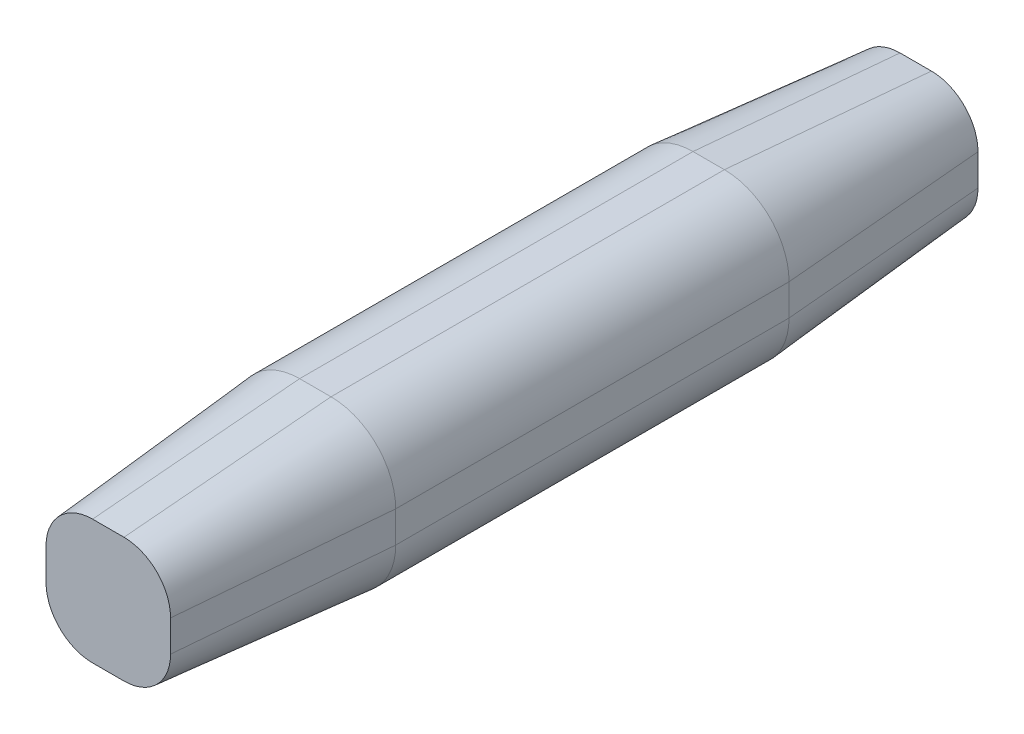
ISO-10303-21;
HEADER;
FILE_DESCRIPTION(('STEP AP214'),'2;1');
FILE_NAME('part.step','',(''),(''),'','','');
FILE_SCHEMA(('AUTOMOTIVE_DESIGN { 1 0 10303 214 1 1 1 1 }'));
ENDSEC;
DATA;
#1=APPLICATION_CONTEXT('core data for automotive mechanical design processes');
#2=APPLICATION_PROTOCOL_DEFINITION('international standard','automotive_design',2000,#1);
#3=PRODUCT_CONTEXT('',#1,'mechanical');
#4=PRODUCT('Part','Part','',(#3));
#5=PRODUCT_RELATED_PRODUCT_CATEGORY('part','',(#4));
#6=PRODUCT_DEFINITION_FORMATION('','',#4);
#7=PRODUCT_DEFINITION_CONTEXT('part definition',#1,'design');
#8=PRODUCT_DEFINITION('design','',#6,#7);
#9=PRODUCT_DEFINITION_SHAPE('','',#8);
#10=(LENGTH_UNIT() NAMED_UNIT(*) SI_UNIT(.MILLI.,.METRE.));
#11=(NAMED_UNIT(*) PLANE_ANGLE_UNIT() SI_UNIT($,.RADIAN.));
#12=(NAMED_UNIT(*) SI_UNIT($,.STERADIAN.) SOLID_ANGLE_UNIT());
#13=UNCERTAINTY_MEASURE_WITH_UNIT(LENGTH_MEASURE(1.E-05),#10,'distance_accuracy_value','');
#14=(GEOMETRIC_REPRESENTATION_CONTEXT(3) GLOBAL_UNCERTAINTY_ASSIGNED_CONTEXT((#13)) GLOBAL_UNIT_ASSIGNED_CONTEXT((#10,
#11,#12)) REPRESENTATION_CONTEXT('',''));
#15=CARTESIAN_POINT('',(0.,0.,0.));
#16=DIRECTION('',(0.,0.,1.));
#17=DIRECTION('',(1.,0.,0.));
#18=AXIS2_PLACEMENT_3D('',#15,#16,#17);
#19=CARTESIAN_POINT('',(0.385,-0.385,4.826));
#20=DIRECTION('',(0.,0.,-1.));
#21=DIRECTION('',(-1.,0.,0.));
#22=AXIS2_PLACEMENT_3D('',#19,#20,#21);
#23=CYLINDRICAL_SURFACE('',#22,1.5875);
#24=DIRECTION('',(0.,0.,-1.));
#25=VECTOR('',#24,1.);
#26=CARTESIAN_POINT('',(0.385,-1.9725,4.826));
#27=LINE('',#26,#25);
#28=CARTESIAN_POINT('',(0.385,-1.9725,4.826));
#29=VERTEX_POINT('',#28);
#30=CARTESIAN_POINT('',(0.385,-1.9725,-4.826));
#31=VERTEX_POINT('',#30);
#32=EDGE_CURVE('E178',#29,#31,#27,.T.);
#33=ORIENTED_EDGE('',*,*,#32,.T.);
#34=CARTESIAN_POINT('',(0.385,-0.385,-4.826));
#35=DIRECTION('',(0.,0.,1.));
#36=DIRECTION('',(1.,0.,0.));
#37=AXIS2_PLACEMENT_3D('',#34,#35,#36);
#38=CIRCLE('',#37,1.5875);
#39=CARTESIAN_POINT('',(1.9725,-0.385,-4.826));
#40=VERTEX_POINT('',#39);
#41=EDGE_CURVE('E166',#31,#40,#38,.T.);
#42=ORIENTED_EDGE('',*,*,#41,.T.);
#43=DIRECTION('',(0.,0.,-1.));
#44=VECTOR('',#43,1.);
#45=CARTESIAN_POINT('',(1.9725,-0.385,4.826));
#46=LINE('',#45,#44);
#47=CARTESIAN_POINT('',(1.9725,-0.385,4.826));
#48=VERTEX_POINT('',#47);
#49=EDGE_CURVE('E11',#48,#40,#46,.T.);
#50=ORIENTED_EDGE('',*,*,#49,.F.);
#51=CARTESIAN_POINT('',(0.385,-0.385,4.826));
#52=DIRECTION('',(0.,0.,1.));
#53=DIRECTION('',(1.,0.,0.));
#54=AXIS2_PLACEMENT_3D('',#51,#52,#53);
#55=CIRCLE('',#54,1.5875);
#56=EDGE_CURVE('E180',#29,#48,#55,.T.);
#57=ORIENTED_EDGE('',*,*,#56,.F.);
#58=EDGE_LOOP('',(#33,#42,#50,#57));
#59=FACE_BOUND('',#58,.T.);
#60=ADVANCED_FACE('F41',(#59),#23,.T.);
#61=CARTESIAN_POINT('',(1.9725,-0.385,4.826));
#62=DIRECTION('',(-1.,0.,0.));
#63=DIRECTION('',(0.,-1.,0.));
#64=AXIS2_PLACEMENT_3D('',#61,#62,#63);
#65=PLANE('',#64);
#66=ORIENTED_EDGE('',*,*,#49,.T.);
#67=DIRECTION('',(0.,1.,0.));
#68=VECTOR('',#67,1.);
#69=CARTESIAN_POINT('',(1.9725,-0.385,-4.826));
#70=LINE('',#69,#68);
#71=CARTESIAN_POINT('',(1.9725,0.385,-4.826));
#72=VERTEX_POINT('',#71);
#73=EDGE_CURVE('E202',#40,#72,#70,.T.);
#74=ORIENTED_EDGE('',*,*,#73,.T.);
#75=DIRECTION('',(0.,0.,-1.));
#76=VECTOR('',#75,1.);
#77=CARTESIAN_POINT('',(1.9725,0.385,4.826));
#78=LINE('',#77,#76);
#79=CARTESIAN_POINT('',(1.9725,0.385,4.826));
#80=VERTEX_POINT('',#79);
#81=EDGE_CURVE('E48',#80,#72,#78,.T.);
#82=ORIENTED_EDGE('',*,*,#81,.F.);
#83=DIRECTION('',(0.,1.,0.));
#84=VECTOR('',#83,1.);
#85=CARTESIAN_POINT('',(1.9725,-0.385,4.826));
#86=LINE('',#85,#84);
#87=EDGE_CURVE('E247',#48,#80,#86,.T.);
#88=ORIENTED_EDGE('',*,*,#87,.F.);
#89=EDGE_LOOP('',(#66,#74,#82,#88));
#90=FACE_BOUND('',#89,.T.);
#91=ADVANCED_FACE('F281',(#90),#65,.F.);
#92=CARTESIAN_POINT('',(0.385,0.385,4.826));
#93=DIRECTION('',(0.,0.,-1.));
#94=DIRECTION('',(-1.,0.,0.));
#95=AXIS2_PLACEMENT_3D('',#92,#93,#94);
#96=CYLINDRICAL_SURFACE('',#95,1.5875);
#97=ORIENTED_EDGE('',*,*,#81,.T.);
#98=CARTESIAN_POINT('',(0.385,0.385,-4.826));
#99=DIRECTION('',(0.,0.,1.));
#100=DIRECTION('',(-1.,0.,0.));
#101=AXIS2_PLACEMENT_3D('',#98,#99,#100);
#102=CIRCLE('',#101,1.5875);
#103=CARTESIAN_POINT('',(0.385,1.9725,-4.826));
#104=VERTEX_POINT('',#103);
#105=EDGE_CURVE('E199',#72,#104,#102,.T.);
#106=ORIENTED_EDGE('',*,*,#105,.T.);
#107=DIRECTION('',(0.,0.,-1.));
#108=VECTOR('',#107,1.);
#109=CARTESIAN_POINT('',(0.385,1.9725,4.826));
#110=LINE('',#109,#108);
#111=CARTESIAN_POINT('',(0.385,1.9725,4.826));
#112=VERTEX_POINT('',#111);
#113=EDGE_CURVE('E274',#112,#104,#110,.T.);
#114=ORIENTED_EDGE('',*,*,#113,.F.);
#115=CARTESIAN_POINT('',(0.385,0.385,4.826));
#116=DIRECTION('',(0.,0.,1.));
#117=DIRECTION('',(-1.,0.,0.));
#118=AXIS2_PLACEMENT_3D('',#115,#116,#117);
#119=CIRCLE('',#118,1.5875);
#120=EDGE_CURVE('E250',#80,#112,#119,.T.);
#121=ORIENTED_EDGE('',*,*,#120,.F.);
#122=EDGE_LOOP('',(#97,#106,#114,#121));
#123=FACE_BOUND('',#122,.T.);
#124=ADVANCED_FACE('F279',(#123),#96,.T.);
#125=CARTESIAN_POINT('',(-0.385,1.9725,4.826));
#126=DIRECTION('',(0.,-1.,0.));
#127=DIRECTION('',(0.,0.,-1.));
#128=AXIS2_PLACEMENT_3D('',#125,#126,#127);
#129=PLANE('',#128);
#130=ORIENTED_EDGE('',*,*,#113,.T.);
#131=DIRECTION('',(-1.,0.,0.));
#132=VECTOR('',#131,1.);
#133=CARTESIAN_POINT('',(-0.385,1.9725,-4.826));
#134=LINE('',#133,#132);
#135=CARTESIAN_POINT('',(-0.385,1.9725,-4.826));
#136=VERTEX_POINT('',#135);
#137=EDGE_CURVE('E196',#104,#136,#134,.T.);
#138=ORIENTED_EDGE('',*,*,#137,.T.);
#139=DIRECTION('',(0.,0.,-1.));
#140=VECTOR('',#139,1.);
#141=CARTESIAN_POINT('',(-0.385,1.9725,4.826));
#142=LINE('',#141,#140);
#143=CARTESIAN_POINT('',(-0.385,1.9725,4.826));
#144=VERTEX_POINT('',#143);
#145=EDGE_CURVE('E271',#144,#136,#142,.T.);
#146=ORIENTED_EDGE('',*,*,#145,.F.);
#147=DIRECTION('',(-1.,0.,0.));
#148=VECTOR('',#147,1.);
#149=CARTESIAN_POINT('',(-0.385,1.9725,4.826));
#150=LINE('',#149,#148);
#151=EDGE_CURVE('E253',#112,#144,#150,.T.);
#152=ORIENTED_EDGE('',*,*,#151,.F.);
#153=EDGE_LOOP('',(#130,#138,#146,#152));
#154=FACE_BOUND('',#153,.T.);
#155=ADVANCED_FACE('F332',(#154),#129,.F.);
#156=CARTESIAN_POINT('',(-0.385,0.385,4.826));
#157=DIRECTION('',(0.,0.,-1.));
#158=DIRECTION('',(-1.,0.,0.));
#159=AXIS2_PLACEMENT_3D('',#156,#157,#158);
#160=CYLINDRICAL_SURFACE('',#159,1.5875);
#161=ORIENTED_EDGE('',*,*,#145,.T.);
#162=CARTESIAN_POINT('',(-0.385,0.385,-4.826));
#163=DIRECTION('',(0.,0.,1.));
#164=DIRECTION('',(-1.,0.,0.));
#165=AXIS2_PLACEMENT_3D('',#162,#163,#164);
#166=CIRCLE('',#165,1.5875);
#167=CARTESIAN_POINT('',(-1.9725,0.385,-4.826));
#168=VERTEX_POINT('',#167);
#169=EDGE_CURVE('E193',#136,#168,#166,.T.);
#170=ORIENTED_EDGE('',*,*,#169,.T.);
#171=DIRECTION('',(0.,0.,-1.));
#172=VECTOR('',#171,1.);
#173=CARTESIAN_POINT('',(-1.9725,0.385,4.826));
#174=LINE('',#173,#172);
#175=CARTESIAN_POINT('',(-1.9725,0.385,4.826));
#176=VERTEX_POINT('',#175);
#177=EDGE_CURVE('E268',#176,#168,#174,.T.);
#178=ORIENTED_EDGE('',*,*,#177,.F.);
#179=CARTESIAN_POINT('',(-0.385,0.385,4.826));
#180=DIRECTION('',(0.,0.,1.));
#181=DIRECTION('',(-1.,0.,0.));
#182=AXIS2_PLACEMENT_3D('',#179,#180,#181);
#183=CIRCLE('',#182,1.5875);
#184=EDGE_CURVE('E256',#144,#176,#183,.T.);
#185=ORIENTED_EDGE('',*,*,#184,.F.);
#186=EDGE_LOOP('',(#161,#170,#178,#185));
#187=FACE_BOUND('',#186,.T.);
#188=ADVANCED_FACE('F370',(#187),#160,.T.);
#189=CARTESIAN_POINT('',(-1.9725,-0.385,4.826));
#190=DIRECTION('',(1.,0.,0.));
#191=DIRECTION('',(0.,0.,-1.));
#192=AXIS2_PLACEMENT_3D('',#189,#190,#191);
#193=PLANE('',#192);
#194=ORIENTED_EDGE('',*,*,#177,.T.);
#195=DIRECTION('',(0.,-1.,0.));
#196=VECTOR('',#195,1.);
#197=CARTESIAN_POINT('',(-1.9725,-0.385,-4.826));
#198=LINE('',#197,#196);
#199=CARTESIAN_POINT('',(-1.9725,-0.385,-4.826));
#200=VERTEX_POINT('',#199);
#201=EDGE_CURVE('E188',#168,#200,#198,.T.);
#202=ORIENTED_EDGE('',*,*,#201,.T.);
#203=DIRECTION('',(0.,0.,-1.));
#204=VECTOR('',#203,1.);
#205=CARTESIAN_POINT('',(-1.9725,-0.385,4.826));
#206=LINE('',#205,#204);
#207=CARTESIAN_POINT('',(-1.9725,-0.385,4.826));
#208=VERTEX_POINT('',#207);
#209=EDGE_CURVE('E63',#208,#200,#206,.T.);
#210=ORIENTED_EDGE('',*,*,#209,.F.);
#211=DIRECTION('',(0.,-1.,0.));
#212=VECTOR('',#211,1.);
#213=CARTESIAN_POINT('',(-1.9725,-0.385,4.826));
#214=LINE('',#213,#212);
#215=EDGE_CURVE('E259',#176,#208,#214,.T.);
#216=ORIENTED_EDGE('',*,*,#215,.F.);
#217=EDGE_LOOP('',(#194,#202,#210,#216));
#218=FACE_BOUND('',#217,.T.);
#219=ADVANCED_FACE('F366',(#218),#193,.F.);
#220=CARTESIAN_POINT('',(-0.385,-0.385,4.826));
#221=DIRECTION('',(0.,0.,-1.));
#222=DIRECTION('',(-1.,0.,0.));
#223=AXIS2_PLACEMENT_3D('',#220,#221,#222);
#224=CYLINDRICAL_SURFACE('',#223,1.5875);
#225=ORIENTED_EDGE('',*,*,#209,.T.);
#226=CARTESIAN_POINT('',(-0.385,-0.385,-4.826));
#227=DIRECTION('',(0.,0.,1.));
#228=DIRECTION('',(-1.,0.,0.));
#229=AXIS2_PLACEMENT_3D('',#226,#227,#228);
#230=CIRCLE('',#229,1.5875);
#231=CARTESIAN_POINT('',(-0.385,-1.9725,-4.826));
#232=VERTEX_POINT('',#231);
#233=EDGE_CURVE('E186',#200,#232,#230,.T.);
#234=ORIENTED_EDGE('',*,*,#233,.T.);
#235=DIRECTION('',(0.,0.,-1.));
#236=VECTOR('',#235,1.);
#237=CARTESIAN_POINT('',(-0.385,-1.9725,4.826));
#238=LINE('',#237,#236);
#239=CARTESIAN_POINT('',(-0.385,-1.9725,4.826));
#240=VERTEX_POINT('',#239);
#241=EDGE_CURVE('E55',#240,#232,#238,.T.);
#242=ORIENTED_EDGE('',*,*,#241,.F.);
#243=CARTESIAN_POINT('',(-0.385,-0.385,4.826));
#244=DIRECTION('',(0.,0.,1.));
#245=DIRECTION('',(-1.,0.,0.));
#246=AXIS2_PLACEMENT_3D('',#243,#244,#245);
#247=CIRCLE('',#246,1.5875);
#248=EDGE_CURVE('E262',#208,#240,#247,.T.);
#249=ORIENTED_EDGE('',*,*,#248,.F.);
#250=EDGE_LOOP('',(#225,#234,#242,#249));
#251=FACE_BOUND('',#250,.T.);
#252=ADVANCED_FACE('F362',(#251),#224,.T.);
#253=CARTESIAN_POINT('',(-0.385,-1.9725,4.826));
#254=DIRECTION('',(0.,1.,0.));
#255=DIRECTION('',(-1.,0.,0.));
#256=AXIS2_PLACEMENT_3D('',#253,#254,#255);
#257=PLANE('',#256);
#258=ORIENTED_EDGE('',*,*,#241,.T.);
#259=DIRECTION('',(1.,0.,0.));
#260=VECTOR('',#259,1.);
#261=CARTESIAN_POINT('',(-0.385,-1.9725,-4.826));
#262=LINE('',#261,#260);
#263=EDGE_CURVE('E160',#232,#31,#262,.T.);
#264=ORIENTED_EDGE('',*,*,#263,.T.);
#265=ORIENTED_EDGE('',*,*,#32,.F.);
#266=DIRECTION('',(1.,0.,0.));
#267=VECTOR('',#266,1.);
#268=CARTESIAN_POINT('',(-0.385,-1.9725,4.826));
#269=LINE('',#268,#267);
#270=EDGE_CURVE('E183',#240,#29,#269,.T.);
#271=ORIENTED_EDGE('',*,*,#270,.F.);
#272=EDGE_LOOP('',(#258,#264,#265,#271));
#273=FACE_BOUND('',#272,.T.);
#274=ADVANCED_FACE('F185',(#273),#257,.F.);
#275=CARTESIAN_POINT('',(0.385,-0.385,4.826));
#276=DIRECTION('',(0.,0.,-1.));
#277=DIRECTION('',(1.,0.,0.));
#278=AXIS2_PLACEMENT_3D('',#275,#276,#277);
#279=CONICAL_SURFACE('',#278,1.5875,0.0872664625997167);
#280=ORIENTED_EDGE('',*,*,#56,.T.);
#281=DIRECTION('',(0.0871557427476584,0.,-0.996194698091745));
#282=VECTOR('',#281,1.);
#283=CARTESIAN_POINT('',(1.9725,-0.385,4.826));
#284=LINE('',#283,#282);
#285=CARTESIAN_POINT('',(1.52805758928831,-0.385,9.906));
#286=VERTEX_POINT('',#285);
#287=EDGE_CURVE('E206',#286,#48,#284,.T.);
#288=ORIENTED_EDGE('',*,*,#287,.F.);
#289=CARTESIAN_POINT('',(0.385,-0.385,9.906));
#290=DIRECTION('',(0.,0.,1.));
#291=DIRECTION('',(1.,0.,0.));
#292=AXIS2_PLACEMENT_3D('',#289,#290,#291);
#293=CIRCLE('',#292,1.14305758928831);
#294=CARTESIAN_POINT('',(0.385,-1.5280575892883,9.906));
#295=VERTEX_POINT('',#294);
#296=EDGE_CURVE('E205',#295,#286,#293,.T.);
#297=ORIENTED_EDGE('',*,*,#296,.F.);
#298=DIRECTION('',(0.,-0.0871557427476584,-0.996194698091745));
#299=VECTOR('',#298,1.);
#300=CARTESIAN_POINT('',(0.385,-1.9725,4.826));
#301=LINE('',#300,#299);
#302=EDGE_CURVE('E210',#295,#29,#301,.T.);
#303=ORIENTED_EDGE('',*,*,#302,.T.);
#304=EDGE_LOOP('',(#280,#288,#297,#303));
#305=FACE_BOUND('',#304,.T.);
#306=ADVANCED_FACE('F352',(#305),#279,.T.);
#307=CARTESIAN_POINT('',(1.9725,-0.385,4.826));
#308=DIRECTION('',(0.996194698091746,0.,0.0871557427476584));
#309=DIRECTION('',(0.0871557427476584,0.,-0.996194698091746));
#310=AXIS2_PLACEMENT_3D('',#307,#308,#309);
#311=PLANE('',#310);
#312=ORIENTED_EDGE('',*,*,#87,.T.);
#313=DIRECTION('',(0.0871557427476584,0.,-0.996194698091745));
#314=VECTOR('',#313,1.);
#315=CARTESIAN_POINT('',(1.9725,0.385,4.826));
#316=LINE('',#315,#314);
#317=CARTESIAN_POINT('',(1.52805758928831,0.385,9.906));
#318=VERTEX_POINT('',#317);
#319=EDGE_CURVE('E209',#318,#80,#316,.T.);
#320=ORIENTED_EDGE('',*,*,#319,.F.);
#321=DIRECTION('',(0.,-1.,0.));
#322=VECTOR('',#321,1.);
#323=CARTESIAN_POINT('',(1.52805758928831,-0.385,9.906));
#324=LINE('',#323,#322);
#325=EDGE_CURVE('E233',#286,#318,#324,.F.);
#326=ORIENTED_EDGE('',*,*,#325,.F.);
#327=ORIENTED_EDGE('',*,*,#287,.T.);
#328=EDGE_LOOP('',(#312,#320,#326,#327));
#329=FACE_BOUND('',#328,.T.);
#330=ADVANCED_FACE('F350',(#329),#311,.T.);
#331=CARTESIAN_POINT('',(0.385,0.385,4.826));
#332=DIRECTION('',(0.,0.,-1.));
#333=DIRECTION('',(1.,0.,0.));
#334=AXIS2_PLACEMENT_3D('',#331,#332,#333);
#335=CONICAL_SURFACE('',#334,1.5875,0.0872664625997167);
#336=ORIENTED_EDGE('',*,*,#120,.T.);
#337=DIRECTION('',(0.,0.0871557427476584,-0.996194698091745));
#338=VECTOR('',#337,1.);
#339=CARTESIAN_POINT('',(0.385,1.9725,4.826));
#340=LINE('',#339,#338);
#341=CARTESIAN_POINT('',(0.385,1.52805758928831,9.906));
#342=VERTEX_POINT('',#341);
#343=EDGE_CURVE('E226',#342,#112,#340,.T.);
#344=ORIENTED_EDGE('',*,*,#343,.F.);
#345=CARTESIAN_POINT('',(0.385,0.385,9.906));
#346=DIRECTION('',(0.,0.,1.));
#347=DIRECTION('',(1.,0.,0.));
#348=AXIS2_PLACEMENT_3D('',#345,#346,#347);
#349=CIRCLE('',#348,1.14305758928831);
#350=EDGE_CURVE('E235',#318,#342,#349,.T.);
#351=ORIENTED_EDGE('',*,*,#350,.F.);
#352=ORIENTED_EDGE('',*,*,#319,.T.);
#353=EDGE_LOOP('',(#336,#344,#351,#352));
#354=FACE_BOUND('',#353,.T.);
#355=ADVANCED_FACE('F338',(#354),#335,.T.);
#356=CARTESIAN_POINT('',(0.385,1.9725,4.826));
#357=DIRECTION('',(0.,0.996194698091746,0.0871557427476584));
#358=DIRECTION('',(0.,-0.0871557427476584,0.996194698091746));
#359=AXIS2_PLACEMENT_3D('',#356,#357,#358);
#360=PLANE('',#359);
#361=ORIENTED_EDGE('',*,*,#151,.T.);
#362=DIRECTION('',(0.,0.0871557427476584,-0.996194698091745));
#363=VECTOR('',#362,1.);
#364=CARTESIAN_POINT('',(-0.385,1.9725,4.826));
#365=LINE('',#364,#363);
#366=CARTESIAN_POINT('',(-0.385,1.52805758928831,9.906));
#367=VERTEX_POINT('',#366);
#368=EDGE_CURVE('E223',#367,#144,#365,.T.);
#369=ORIENTED_EDGE('',*,*,#368,.F.);
#370=DIRECTION('',(1.,0.,0.));
#371=VECTOR('',#370,1.);
#372=CARTESIAN_POINT('',(0.385,1.52805758928831,9.906));
#373=LINE('',#372,#371);
#374=EDGE_CURVE('E237',#342,#367,#373,.F.);
#375=ORIENTED_EDGE('',*,*,#374,.F.);
#376=ORIENTED_EDGE('',*,*,#343,.T.);
#377=EDGE_LOOP('',(#361,#369,#375,#376));
#378=FACE_BOUND('',#377,.T.);
#379=ADVANCED_FACE('F342',(#378),#360,.T.);
#380=CARTESIAN_POINT('',(-0.385,0.385,4.826));
#381=DIRECTION('',(0.,0.,-1.));
#382=DIRECTION('',(1.,0.,0.));
#383=AXIS2_PLACEMENT_3D('',#380,#381,#382);
#384=CONICAL_SURFACE('',#383,1.5875,0.0872664625997167);
#385=ORIENTED_EDGE('',*,*,#184,.T.);
#386=DIRECTION('',(-0.0871557427476584,0.,-0.996194698091745));
#387=VECTOR('',#386,1.);
#388=CARTESIAN_POINT('',(-1.9725,0.385,4.826));
#389=LINE('',#388,#387);
#390=CARTESIAN_POINT('',(-1.52805758928831,0.385000000000001,9.906));
#391=VERTEX_POINT('',#390);
#392=EDGE_CURVE('E220',#391,#176,#389,.T.);
#393=ORIENTED_EDGE('',*,*,#392,.F.);
#394=CARTESIAN_POINT('',(-0.385,0.385,9.906));
#395=DIRECTION('',(0.,0.,1.));
#396=DIRECTION('',(1.,0.,0.));
#397=AXIS2_PLACEMENT_3D('',#394,#395,#396);
#398=CIRCLE('',#397,1.14305758928831);
#399=EDGE_CURVE('E239',#367,#391,#398,.T.);
#400=ORIENTED_EDGE('',*,*,#399,.F.);
#401=ORIENTED_EDGE('',*,*,#368,.T.);
#402=EDGE_LOOP('',(#385,#393,#400,#401));
#403=FACE_BOUND('',#402,.T.);
#404=ADVANCED_FACE('F368',(#403),#384,.T.);
#405=CARTESIAN_POINT('',(-1.9725,0.385,4.826));
#406=DIRECTION('',(-0.996194698091746,0.,0.0871557427476584));
#407=DIRECTION('',(0.0871557427476584,0.,0.996194698091746));
#408=AXIS2_PLACEMENT_3D('',#405,#406,#407);
#409=PLANE('',#408);
#410=ORIENTED_EDGE('',*,*,#215,.T.);
#411=DIRECTION('',(-0.0871557427476584,0.,-0.996194698091745));
#412=VECTOR('',#411,1.);
#413=CARTESIAN_POINT('',(-1.9725,-0.385,4.826));
#414=LINE('',#413,#412);
#415=CARTESIAN_POINT('',(-1.5280575892883,-0.385,9.906));
#416=VERTEX_POINT('',#415);
#417=EDGE_CURVE('E217',#416,#208,#414,.T.);
#418=ORIENTED_EDGE('',*,*,#417,.F.);
#419=DIRECTION('',(0.,1.,0.));
#420=VECTOR('',#419,1.);
#421=CARTESIAN_POINT('',(-1.52805758928831,0.385000000000001,9.906));
#422=LINE('',#421,#420);
#423=EDGE_CURVE('E241',#391,#416,#422,.F.);
#424=ORIENTED_EDGE('',*,*,#423,.F.);
#425=ORIENTED_EDGE('',*,*,#392,.T.);
#426=EDGE_LOOP('',(#410,#418,#424,#425));
#427=FACE_BOUND('',#426,.T.);
#428=ADVANCED_FACE('F364',(#427),#409,.T.);
#429=CARTESIAN_POINT('',(-0.385,-0.385,4.826));
#430=DIRECTION('',(0.,0.,-1.));
#431=DIRECTION('',(1.,0.,0.));
#432=AXIS2_PLACEMENT_3D('',#429,#430,#431);
#433=CONICAL_SURFACE('',#432,1.5875,0.0872664625997167);
#434=ORIENTED_EDGE('',*,*,#248,.T.);
#435=DIRECTION('',(0.,-0.0871557427476584,-0.996194698091745));
#436=VECTOR('',#435,1.);
#437=CARTESIAN_POINT('',(-0.385,-1.9725,4.826));
#438=LINE('',#437,#436);
#439=CARTESIAN_POINT('',(-0.385,-1.5280575892883,9.906));
#440=VERTEX_POINT('',#439);
#441=EDGE_CURVE('E213',#440,#240,#438,.T.);
#442=ORIENTED_EDGE('',*,*,#441,.F.);
#443=CARTESIAN_POINT('',(-0.385,-0.385,9.906));
#444=DIRECTION('',(0.,0.,1.));
#445=DIRECTION('',(1.,0.,0.));
#446=AXIS2_PLACEMENT_3D('',#443,#444,#445);
#447=CIRCLE('',#446,1.1430575892883);
#448=EDGE_CURVE('E243',#416,#440,#447,.T.);
#449=ORIENTED_EDGE('',*,*,#448,.F.);
#450=ORIENTED_EDGE('',*,*,#417,.T.);
#451=EDGE_LOOP('',(#434,#442,#449,#450));
#452=FACE_BOUND('',#451,.T.);
#453=ADVANCED_FACE('F359',(#452),#433,.T.);
#454=CARTESIAN_POINT('',(-0.385,-1.9725,4.826));
#455=DIRECTION('',(0.,-0.996194698091746,0.0871557427476584));
#456=DIRECTION('',(0.,-0.0871557427476584,-0.996194698091746));
#457=AXIS2_PLACEMENT_3D('',#454,#455,#456);
#458=PLANE('',#457);
#459=ORIENTED_EDGE('',*,*,#270,.T.);
#460=ORIENTED_EDGE('',*,*,#302,.F.);
#461=DIRECTION('',(-1.,0.,0.));
#462=VECTOR('',#461,1.);
#463=CARTESIAN_POINT('',(-0.385,-1.5280575892883,9.906));
#464=LINE('',#463,#462);
#465=EDGE_CURVE('E214',#440,#295,#464,.F.);
#466=ORIENTED_EDGE('',*,*,#465,.F.);
#467=ORIENTED_EDGE('',*,*,#441,.T.);
#468=EDGE_LOOP('',(#459,#460,#466,#467));
#469=FACE_BOUND('',#468,.T.);
#470=ADVANCED_FACE('F356',(#469),#458,.T.);
#471=CARTESIAN_POINT('',(0.385,-0.385,9.906));
#472=DIRECTION('',(0.,0.,1.));
#473=DIRECTION('',(1.,0.,0.));
#474=AXIS2_PLACEMENT_3D('',#471,#472,#473);
#475=PLANE('',#474);
#476=ORIENTED_EDGE('',*,*,#296,.T.);
#477=ORIENTED_EDGE('',*,*,#325,.T.);
#478=ORIENTED_EDGE('',*,*,#350,.T.);
#479=ORIENTED_EDGE('',*,*,#374,.T.);
#480=ORIENTED_EDGE('',*,*,#399,.T.);
#481=ORIENTED_EDGE('',*,*,#423,.T.);
#482=ORIENTED_EDGE('',*,*,#448,.T.);
#483=ORIENTED_EDGE('',*,*,#465,.T.);
#484=EDGE_LOOP('',(#476,#477,#478,#479,#480,#481,#482,#483));
#485=FACE_BOUND('',#484,.T.);
#486=ADVANCED_FACE('F345',(#485),#475,.T.);
#487=CARTESIAN_POINT('',(0.385,-0.385,-4.826));
#488=DIRECTION('',(0.,0.,1.));
#489=DIRECTION('',(1.,0.,0.));
#490=AXIS2_PLACEMENT_3D('',#487,#488,#489);
#491=CONICAL_SURFACE('',#490,1.5875,0.0872664625997167);
#492=ORIENTED_EDGE('',*,*,#41,.F.);
#493=DIRECTION('',(0.,-0.0871557427476584,0.996194698091745));
#494=VECTOR('',#493,1.);
#495=CARTESIAN_POINT('',(0.385,-1.9725,-4.826));
#496=LINE('',#495,#494);
#497=CARTESIAN_POINT('',(0.385,-1.52805758928831,-9.906));
#498=VERTEX_POINT('',#497);
#499=EDGE_CURVE('E156',#498,#31,#496,.T.);
#500=ORIENTED_EDGE('',*,*,#499,.F.);
#501=CARTESIAN_POINT('',(0.385,-0.385,-9.906));
#502=DIRECTION('',(0.,0.,-1.));
#503=DIRECTION('',(-1.,0.,0.));
#504=AXIS2_PLACEMENT_3D('',#501,#502,#503);
#505=CIRCLE('',#504,1.14305758928831);
#506=CARTESIAN_POINT('',(1.5280575892883,-0.385,-9.906));
#507=VERTEX_POINT('',#506);
#508=EDGE_CURVE('E304',#498,#507,#505,.F.);
#509=ORIENTED_EDGE('',*,*,#508,.T.);
#510=DIRECTION('',(0.0871557427476584,0.,0.996194698091745));
#511=VECTOR('',#510,1.);
#512=CARTESIAN_POINT('',(1.9725,-0.385,-4.826));
#513=LINE('',#512,#511);
#514=EDGE_CURVE('E172',#507,#40,#513,.T.);
#515=ORIENTED_EDGE('',*,*,#514,.T.);
#516=EDGE_LOOP('',(#492,#500,#509,#515));
#517=FACE_BOUND('',#516,.T.);
#518=ADVANCED_FACE('F171',(#517),#491,.T.);
#519=CARTESIAN_POINT('',(-0.385,-1.9725,-4.826));
#520=DIRECTION('',(0.,-0.996194698091746,-0.0871557427476584));
#521=DIRECTION('',(0.,0.0871557427476584,-0.996194698091746));
#522=AXIS2_PLACEMENT_3D('',#519,#520,#521);
#523=PLANE('',#522);
#524=ORIENTED_EDGE('',*,*,#263,.F.);
#525=DIRECTION('',(0.,-0.0871557427476584,0.996194698091745));
#526=VECTOR('',#525,1.);
#527=CARTESIAN_POINT('',(-0.385,-1.9725,-4.826));
#528=LINE('',#527,#526);
#529=CARTESIAN_POINT('',(-0.385,-1.5280575892883,-9.906));
#530=VERTEX_POINT('',#529);
#531=EDGE_CURVE('E167',#530,#232,#528,.T.);
#532=ORIENTED_EDGE('',*,*,#531,.F.);
#533=DIRECTION('',(1.,0.,0.));
#534=VECTOR('',#533,1.);
#535=CARTESIAN_POINT('',(-0.385,-1.5280575892883,-9.906));
#536=LINE('',#535,#534);
#537=EDGE_CURVE('E162',#530,#498,#536,.T.);
#538=ORIENTED_EDGE('',*,*,#537,.T.);
#539=ORIENTED_EDGE('',*,*,#499,.T.);
#540=EDGE_LOOP('',(#524,#532,#538,#539));
#541=FACE_BOUND('',#540,.T.);
#542=ADVANCED_FACE('F158',(#541),#523,.T.);
#543=CARTESIAN_POINT('',(-0.385,-0.385,-4.826));
#544=DIRECTION('',(0.,0.,1.));
#545=DIRECTION('',(1.,0.,0.));
#546=AXIS2_PLACEMENT_3D('',#543,#544,#545);
#547=CONICAL_SURFACE('',#546,1.5875,0.0872664625997167);
#548=ORIENTED_EDGE('',*,*,#233,.F.);
#549=DIRECTION('',(-0.0871557427476584,0.,0.996194698091745));
#550=VECTOR('',#549,1.);
#551=CARTESIAN_POINT('',(-1.9725,-0.385,-4.826));
#552=LINE('',#551,#550);
#553=CARTESIAN_POINT('',(-1.5280575892883,-0.384999999999999,-9.906));
#554=VERTEX_POINT('',#553);
#555=EDGE_CURVE('E301',#554,#200,#552,.T.);
#556=ORIENTED_EDGE('',*,*,#555,.F.);
#557=CARTESIAN_POINT('',(-0.385,-0.385,-9.906));
#558=DIRECTION('',(0.,0.,-1.));
#559=DIRECTION('',(-1.,0.,0.));
#560=AXIS2_PLACEMENT_3D('',#557,#558,#559);
#561=CIRCLE('',#560,1.1430575892883);
#562=EDGE_CURVE('E307',#554,#530,#561,.F.);
#563=ORIENTED_EDGE('',*,*,#562,.T.);
#564=ORIENTED_EDGE('',*,*,#531,.T.);
#565=EDGE_LOOP('',(#548,#556,#563,#564));
#566=FACE_BOUND('',#565,.T.);
#567=ADVANCED_FACE('F379',(#566),#547,.T.);
#568=CARTESIAN_POINT('',(-1.9725,0.385,-4.826));
#569=DIRECTION('',(-0.996194698091746,0.,-0.0871557427476584));
#570=DIRECTION('',(-0.0871557427476584,0.,0.996194698091746));
#571=AXIS2_PLACEMENT_3D('',#568,#569,#570);
#572=PLANE('',#571);
#573=ORIENTED_EDGE('',*,*,#201,.F.);
#574=DIRECTION('',(-0.0871557427476584,0.,0.996194698091745));
#575=VECTOR('',#574,1.);
#576=CARTESIAN_POINT('',(-1.9725,0.385,-4.826));
#577=LINE('',#576,#575);
#578=CARTESIAN_POINT('',(-1.52805758928831,0.385,-9.906));
#579=VERTEX_POINT('',#578);
#580=EDGE_CURVE('E299',#579,#168,#577,.T.);
#581=ORIENTED_EDGE('',*,*,#580,.F.);
#582=DIRECTION('',(0.,-1.,0.));
#583=VECTOR('',#582,1.);
#584=CARTESIAN_POINT('',(-1.52805758928831,0.385000000000001,-9.906));
#585=LINE('',#584,#583);
#586=EDGE_CURVE('E310',#579,#554,#585,.T.);
#587=ORIENTED_EDGE('',*,*,#586,.T.);
#588=ORIENTED_EDGE('',*,*,#555,.T.);
#589=EDGE_LOOP('',(#573,#581,#587,#588));
#590=FACE_BOUND('',#589,.T.);
#591=ADVANCED_FACE('F375',(#590),#572,.T.);
#592=CARTESIAN_POINT('',(-0.385,0.385,-4.826));
#593=DIRECTION('',(0.,0.,1.));
#594=DIRECTION('',(1.,0.,0.));
#595=AXIS2_PLACEMENT_3D('',#592,#593,#594);
#596=CONICAL_SURFACE('',#595,1.5875,0.0872664625997167);
#597=ORIENTED_EDGE('',*,*,#169,.F.);
#598=DIRECTION('',(0.,0.0871557427476584,0.996194698091745));
#599=VECTOR('',#598,1.);
#600=CARTESIAN_POINT('',(-0.385,1.9725,-4.826));
#601=LINE('',#600,#599);
#602=CARTESIAN_POINT('',(-0.385,1.52805758928831,-9.906));
#603=VERTEX_POINT('',#602);
#604=EDGE_CURVE('E294',#603,#136,#601,.T.);
#605=ORIENTED_EDGE('',*,*,#604,.F.);
#606=CARTESIAN_POINT('',(-0.385,0.385,-9.906));
#607=DIRECTION('',(0.,0.,-1.));
#608=DIRECTION('',(-1.,0.,0.));
#609=AXIS2_PLACEMENT_3D('',#606,#607,#608);
#610=CIRCLE('',#609,1.14305758928831);
#611=EDGE_CURVE('E313',#603,#579,#610,.F.);
#612=ORIENTED_EDGE('',*,*,#611,.T.);
#613=ORIENTED_EDGE('',*,*,#580,.T.);
#614=EDGE_LOOP('',(#597,#605,#612,#613));
#615=FACE_BOUND('',#614,.T.);
#616=ADVANCED_FACE('F372',(#615),#596,.T.);
#617=CARTESIAN_POINT('',(0.385,1.9725,-4.826));
#618=DIRECTION('',(0.,0.996194698091746,-0.0871557427476584));
#619=DIRECTION('',(0.,0.0871557427476584,0.996194698091746));
#620=AXIS2_PLACEMENT_3D('',#617,#618,#619);
#621=PLANE('',#620);
#622=ORIENTED_EDGE('',*,*,#137,.F.);
#623=DIRECTION('',(0.,0.0871557427476584,0.996194698091745));
#624=VECTOR('',#623,1.);
#625=CARTESIAN_POINT('',(0.385,1.9725,-4.826));
#626=LINE('',#625,#624);
#627=CARTESIAN_POINT('',(0.385,1.52805758928831,-9.906));
#628=VERTEX_POINT('',#627);
#629=EDGE_CURVE('E292',#628,#104,#626,.T.);
#630=ORIENTED_EDGE('',*,*,#629,.F.);
#631=DIRECTION('',(-1.,0.,0.));
#632=VECTOR('',#631,1.);
#633=CARTESIAN_POINT('',(0.385,1.52805758928831,-9.906));
#634=LINE('',#633,#632);
#635=EDGE_CURVE('E316',#628,#603,#634,.T.);
#636=ORIENTED_EDGE('',*,*,#635,.T.);
#637=ORIENTED_EDGE('',*,*,#604,.T.);
#638=EDGE_LOOP('',(#622,#630,#636,#637));
#639=FACE_BOUND('',#638,.T.);
#640=ADVANCED_FACE('F328',(#639),#621,.T.);
#641=CARTESIAN_POINT('',(0.385,0.385,-4.826));
#642=DIRECTION('',(0.,0.,1.));
#643=DIRECTION('',(1.,0.,0.));
#644=AXIS2_PLACEMENT_3D('',#641,#642,#643);
#645=CONICAL_SURFACE('',#644,1.5875,0.0872664625997167);
#646=ORIENTED_EDGE('',*,*,#105,.F.);
#647=DIRECTION('',(0.0871557427476584,0.,0.996194698091745));
#648=VECTOR('',#647,1.);
#649=CARTESIAN_POINT('',(1.9725,0.385,-4.826));
#650=LINE('',#649,#648);
#651=CARTESIAN_POINT('',(1.52805758928831,0.385,-9.906));
#652=VERTEX_POINT('',#651);
#653=EDGE_CURVE('E286',#652,#72,#650,.T.);
#654=ORIENTED_EDGE('',*,*,#653,.F.);
#655=CARTESIAN_POINT('',(0.385,0.385,-9.906));
#656=DIRECTION('',(0.,0.,-1.));
#657=DIRECTION('',(-1.,0.,0.));
#658=AXIS2_PLACEMENT_3D('',#655,#656,#657);
#659=CIRCLE('',#658,1.14305758928831);
#660=EDGE_CURVE('E319',#652,#628,#659,.F.);
#661=ORIENTED_EDGE('',*,*,#660,.T.);
#662=ORIENTED_EDGE('',*,*,#629,.T.);
#663=EDGE_LOOP('',(#646,#654,#661,#662));
#664=FACE_BOUND('',#663,.T.);
#665=ADVANCED_FACE('F320',(#664),#645,.T.);
#666=CARTESIAN_POINT('',(1.9725,-0.385,-4.826));
#667=DIRECTION('',(0.996194698091746,0.,-0.0871557427476584));
#668=DIRECTION('',(-0.0871557427476584,0.,-0.996194698091746));
#669=AXIS2_PLACEMENT_3D('',#666,#667,#668);
#670=PLANE('',#669);
#671=ORIENTED_EDGE('',*,*,#73,.F.);
#672=ORIENTED_EDGE('',*,*,#514,.F.);
#673=DIRECTION('',(0.,1.,0.));
#674=VECTOR('',#673,1.);
#675=CARTESIAN_POINT('',(1.52805758928831,-0.385,-9.906));
#676=LINE('',#675,#674);
#677=EDGE_CURVE('E288',#507,#652,#676,.T.);
#678=ORIENTED_EDGE('',*,*,#677,.T.);
#679=ORIENTED_EDGE('',*,*,#653,.T.);
#680=EDGE_LOOP('',(#671,#672,#678,#679));
#681=FACE_BOUND('',#680,.T.);
#682=ADVANCED_FACE('F284',(#681),#670,.T.);
#683=CARTESIAN_POINT('',(0.385,-0.385,-9.906));
#684=DIRECTION('',(0.,0.,-1.));
#685=DIRECTION('',(1.,0.,0.));
#686=AXIS2_PLACEMENT_3D('',#683,#684,#685);
#687=PLANE('',#686);
#688=ORIENTED_EDGE('',*,*,#508,.F.);
#689=ORIENTED_EDGE('',*,*,#537,.F.);
#690=ORIENTED_EDGE('',*,*,#562,.F.);
#691=ORIENTED_EDGE('',*,*,#586,.F.);
#692=ORIENTED_EDGE('',*,*,#611,.F.);
#693=ORIENTED_EDGE('',*,*,#635,.F.);
#694=ORIENTED_EDGE('',*,*,#660,.F.);
#695=ORIENTED_EDGE('',*,*,#677,.F.);
#696=EDGE_LOOP('',(#688,#689,#690,#691,#692,#693,#694,#695));
#697=FACE_BOUND('',#696,.T.);
#698=ADVANCED_FACE('F324',(#697),#687,.T.);
#699=CLOSED_SHELL('',(#60,#91,#124,#155,#188,#219,#252,#274,#306,#330,#355,#379,#404,#428,#453,
#470,#486,#518,#542,#567,#591,#616,#640,#665,#682,#698));
#700=MANIFOLD_SOLID_BREP('B2',#699);
#701=ADVANCED_BREP_SHAPE_REPRESENTATION('',(#18,#700),#14);
#702=SHAPE_DEFINITION_REPRESENTATION(#9,#701);
ENDSEC;
END-ISO-10303-21;
